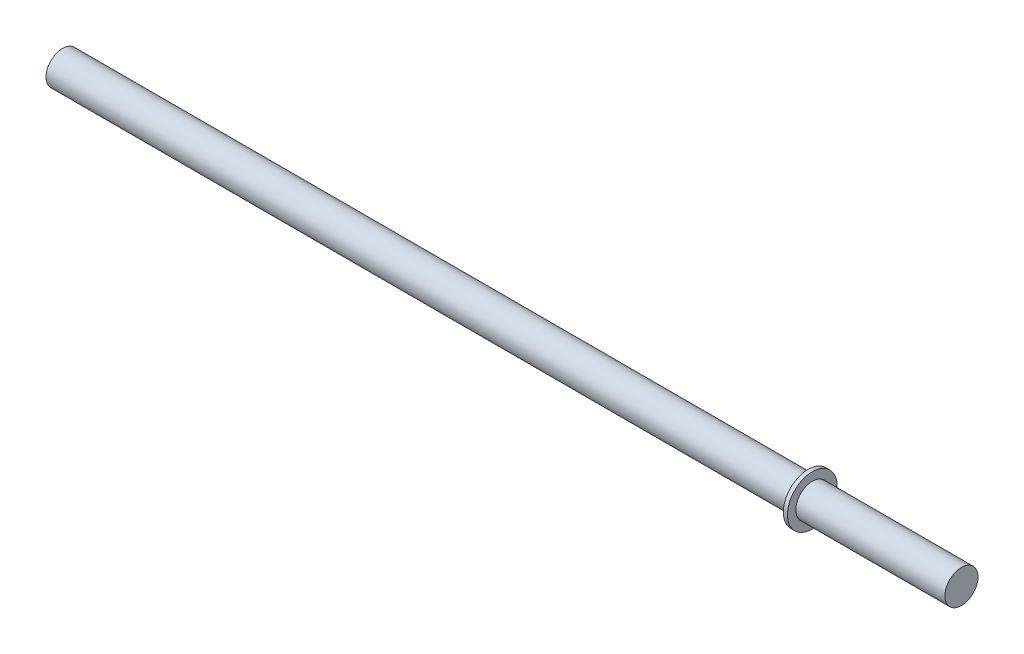
ISO-10303-21;
HEADER;
FILE_DESCRIPTION(('STEP AP214'),'2;1');
FILE_NAME('part.step','',(''),(''),'','','');
FILE_SCHEMA(('AUTOMOTIVE_DESIGN { 1 0 10303 214 1 1 1 1 }'));
ENDSEC;
DATA;
#1=APPLICATION_CONTEXT('core data for automotive mechanical design processes');
#2=APPLICATION_PROTOCOL_DEFINITION('international standard','automotive_design',2000,#1);
#3=PRODUCT_CONTEXT('',#1,'mechanical');
#4=PRODUCT('Part','Part','',(#3));
#5=PRODUCT_RELATED_PRODUCT_CATEGORY('part','',(#4));
#6=PRODUCT_DEFINITION_FORMATION('','',#4);
#7=PRODUCT_DEFINITION_CONTEXT('part definition',#1,'design');
#8=PRODUCT_DEFINITION('design','',#6,#7);
#9=PRODUCT_DEFINITION_SHAPE('','',#8);
#10=(LENGTH_UNIT() NAMED_UNIT(*) SI_UNIT(.MILLI.,.METRE.));
#11=(NAMED_UNIT(*) PLANE_ANGLE_UNIT() SI_UNIT($,.RADIAN.));
#12=(NAMED_UNIT(*) SI_UNIT($,.STERADIAN.) SOLID_ANGLE_UNIT());
#13=UNCERTAINTY_MEASURE_WITH_UNIT(LENGTH_MEASURE(1.E-05),#10,'distance_accuracy_value','');
#14=(GEOMETRIC_REPRESENTATION_CONTEXT(3) GLOBAL_UNCERTAINTY_ASSIGNED_CONTEXT((#13)) GLOBAL_UNIT_ASSIGNED_CONTEXT((#10,
#11,#12)) REPRESENTATION_CONTEXT('',''));
#15=CARTESIAN_POINT('',(0.,0.,0.));
#16=DIRECTION('',(0.,0.,1.));
#17=DIRECTION('',(1.,0.,0.));
#18=AXIS2_PLACEMENT_3D('',#15,#16,#17);
#19=CARTESIAN_POINT('',(0.,0.,0.));
#20=DIRECTION('',(1.,0.,0.));
#21=DIRECTION('',(0.,0.,-1.));
#22=AXIS2_PLACEMENT_3D('',#19,#20,#21);
#23=PLANE('',#22);
#24=CARTESIAN_POINT('',(0.,0.,0.));
#25=DIRECTION('',(-1.,0.,0.));
#26=DIRECTION('',(0.,0.,1.));
#27=AXIS2_PLACEMENT_3D('',#24,#25,#26);
#28=CIRCLE('',#27,2.);
#29=CARTESIAN_POINT('',(0.,0.,2.));
#30=VERTEX_POINT('',#29);
#31=EDGE_CURVE('E10',#30,#30,#28,.T.);
#32=ORIENTED_EDGE('',*,*,#31,.T.);
#33=EDGE_LOOP('',(#32));
#34=FACE_BOUND('',#33,.T.);
#35=ADVANCED_FACE('F32',(#34),#23,.F.);
#36=CARTESIAN_POINT('',(0.,0.,0.));
#37=DIRECTION('',(-1.,0.,0.));
#38=DIRECTION('',(0.,0.,1.));
#39=AXIS2_PLACEMENT_3D('',#36,#37,#38);
#40=CYLINDRICAL_SURFACE('',#39,2.);
#41=ORIENTED_EDGE('',*,*,#31,.F.);
#42=EDGE_LOOP('',(#41));
#43=FACE_BOUND('',#42,.T.);
#44=CARTESIAN_POINT('',(90.,0.,0.));
#45=DIRECTION('',(-1.,0.,0.));
#46=DIRECTION('',(0.,0.,1.));
#47=AXIS2_PLACEMENT_3D('',#44,#45,#46);
#48=CIRCLE('',#47,2.);
#49=CARTESIAN_POINT('',(90.,0.,2.));
#50=VERTEX_POINT('',#49);
#51=EDGE_CURVE('E38',#50,#50,#48,.T.);
#52=ORIENTED_EDGE('',*,*,#51,.T.);
#53=EDGE_LOOP('',(#52));
#54=FACE_BOUND('',#53,.T.);
#55=ADVANCED_FACE('F70',(#43,#54),#40,.T.);
#56=CARTESIAN_POINT('',(90.,2.,0.));
#57=DIRECTION('',(1.,0.,0.));
#58=DIRECTION('',(0.,0.,-1.));
#59=AXIS2_PLACEMENT_3D('',#56,#57,#58);
#60=PLANE('',#59);
#61=ORIENTED_EDGE('',*,*,#51,.F.);
#62=EDGE_LOOP('',(#61));
#63=FACE_BOUND('',#62,.T.);
#64=CARTESIAN_POINT('',(90.,0.,0.));
#65=DIRECTION('',(-1.,0.,0.));
#66=DIRECTION('',(0.,0.,1.));
#67=AXIS2_PLACEMENT_3D('',#64,#65,#66);
#68=CIRCLE('',#67,3.);
#69=CARTESIAN_POINT('',(90.,0.,3.));
#70=VERTEX_POINT('',#69);
#71=EDGE_CURVE('E42',#70,#70,#68,.T.);
#72=ORIENTED_EDGE('',*,*,#71,.T.);
#73=EDGE_LOOP('',(#72));
#74=FACE_BOUND('',#73,.T.);
#75=ADVANCED_FACE('F74',(#63,#74),#60,.F.);
#76=CARTESIAN_POINT('',(0.,0.,0.));
#77=DIRECTION('',(-1.,0.,0.));
#78=DIRECTION('',(0.,0.,1.));
#79=AXIS2_PLACEMENT_3D('',#76,#77,#78);
#80=CYLINDRICAL_SURFACE('',#79,3.);
#81=ORIENTED_EDGE('',*,*,#71,.F.);
#82=EDGE_LOOP('',(#81));
#83=FACE_BOUND('',#82,.T.);
#84=CARTESIAN_POINT('',(90.5,0.,0.));
#85=DIRECTION('',(-1.,0.,0.));
#86=DIRECTION('',(0.,0.,1.));
#87=AXIS2_PLACEMENT_3D('',#84,#85,#86);
#88=CIRCLE('',#87,3.);
#89=CARTESIAN_POINT('',(90.5,0.,3.));
#90=VERTEX_POINT('',#89);
#91=EDGE_CURVE('E46',#90,#90,#88,.T.);
#92=ORIENTED_EDGE('',*,*,#91,.T.);
#93=EDGE_LOOP('',(#92));
#94=FACE_BOUND('',#93,.T.);
#95=ADVANCED_FACE('F79',(#83,#94),#80,.T.);
#96=CARTESIAN_POINT('',(90.5,3.,0.));
#97=DIRECTION('',(-1.,0.,0.));
#98=DIRECTION('',(0.,0.,1.));
#99=AXIS2_PLACEMENT_3D('',#96,#97,#98);
#100=PLANE('',#99);
#101=ORIENTED_EDGE('',*,*,#91,.F.);
#102=EDGE_LOOP('',(#101));
#103=FACE_BOUND('',#102,.T.);
#104=CARTESIAN_POINT('',(90.5,0.,0.));
#105=DIRECTION('',(-1.,0.,0.));
#106=DIRECTION('',(0.,0.,1.));
#107=AXIS2_PLACEMENT_3D('',#104,#105,#106);
#108=CIRCLE('',#107,2.);
#109=CARTESIAN_POINT('',(90.5,0.,2.));
#110=VERTEX_POINT('',#109);
#111=EDGE_CURVE('E51',#110,#110,#108,.T.);
#112=ORIENTED_EDGE('',*,*,#111,.T.);
#113=EDGE_LOOP('',(#112));
#114=FACE_BOUND('',#113,.T.);
#115=ADVANCED_FACE('F66',(#103,#114),#100,.F.);
#116=CARTESIAN_POINT('',(0.,0.,0.));
#117=DIRECTION('',(-1.,0.,0.));
#118=DIRECTION('',(0.,0.,1.));
#119=AXIS2_PLACEMENT_3D('',#116,#117,#118);
#120=CYLINDRICAL_SURFACE('',#119,2.);
#121=ORIENTED_EDGE('',*,*,#111,.F.);
#122=EDGE_LOOP('',(#121));
#123=FACE_BOUND('',#122,.T.);
#124=CARTESIAN_POINT('',(108.5,0.,0.));
#125=DIRECTION('',(-1.,0.,0.));
#126=DIRECTION('',(0.,0.,1.));
#127=AXIS2_PLACEMENT_3D('',#124,#125,#126);
#128=CIRCLE('',#127,2.);
#129=CARTESIAN_POINT('',(108.5,0.,2.));
#130=VERTEX_POINT('',#129);
#131=EDGE_CURVE('E54',#130,#130,#128,.T.);
#132=ORIENTED_EDGE('',*,*,#131,.T.);
#133=EDGE_LOOP('',(#132));
#134=FACE_BOUND('',#133,.T.);
#135=ADVANCED_FACE('F58',(#123,#134),#120,.T.);
#136=CARTESIAN_POINT('',(108.5,2.,0.));
#137=DIRECTION('',(-1.,0.,0.));
#138=DIRECTION('',(0.,0.,1.));
#139=AXIS2_PLACEMENT_3D('',#136,#137,#138);
#140=PLANE('',#139);
#141=ORIENTED_EDGE('',*,*,#131,.F.);
#142=EDGE_LOOP('',(#141));
#143=FACE_BOUND('',#142,.T.);
#144=ADVANCED_FACE('F60',(#143),#140,.F.);
#145=CLOSED_SHELL('',(#35,#55,#75,#95,#115,#135,#144));
#146=MANIFOLD_SOLID_BREP('B2',#145);
#147=ADVANCED_BREP_SHAPE_REPRESENTATION('',(#18,#146),#14);
#148=SHAPE_DEFINITION_REPRESENTATION(#9,#147);
ENDSEC;
END-ISO-10303-21;
